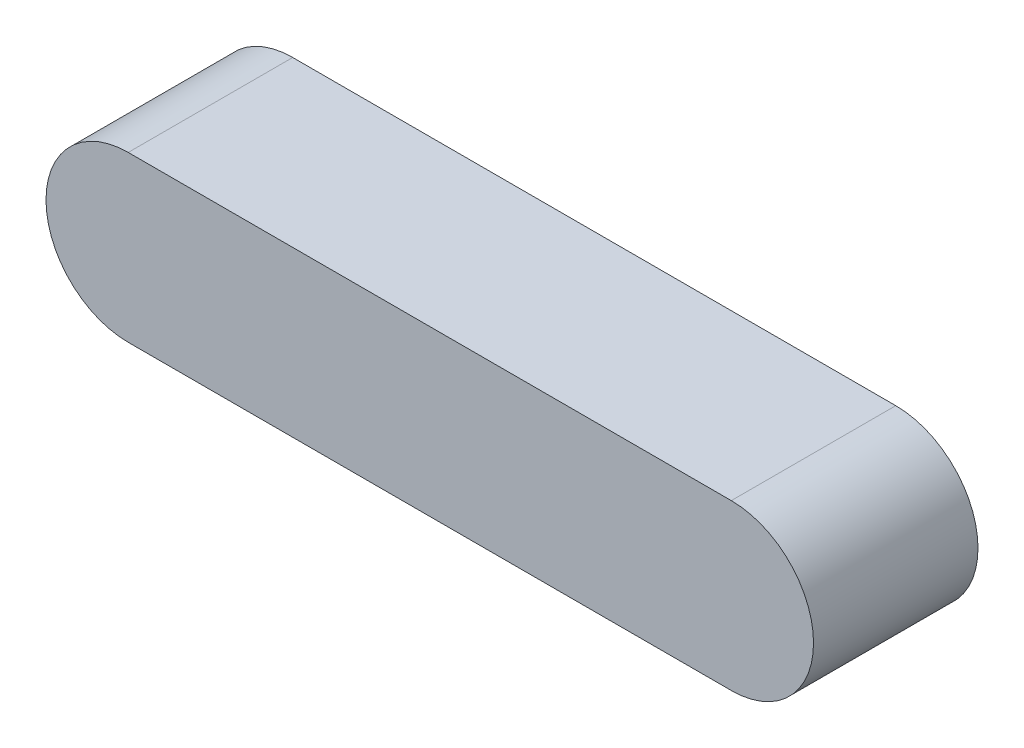
ISO-10303-21;
HEADER;
FILE_DESCRIPTION(('STEP AP214'),'2;1');
FILE_NAME('part.step','',(''),(''),'','','');
FILE_SCHEMA(('AUTOMOTIVE_DESIGN { 1 0 10303 214 1 1 1 1 }'));
ENDSEC;
DATA;
#1=APPLICATION_CONTEXT('core data for automotive mechanical design processes');
#2=APPLICATION_PROTOCOL_DEFINITION('international standard','automotive_design',2000,#1);
#3=PRODUCT_CONTEXT('',#1,'mechanical');
#4=PRODUCT('Part','Part','',(#3));
#5=PRODUCT_RELATED_PRODUCT_CATEGORY('part','',(#4));
#6=PRODUCT_DEFINITION_FORMATION('','',#4);
#7=PRODUCT_DEFINITION_CONTEXT('part definition',#1,'design');
#8=PRODUCT_DEFINITION('design','',#6,#7);
#9=PRODUCT_DEFINITION_SHAPE('','',#8);
#10=(LENGTH_UNIT() NAMED_UNIT(*) SI_UNIT(.MILLI.,.METRE.));
#11=(NAMED_UNIT(*) PLANE_ANGLE_UNIT() SI_UNIT($,.RADIAN.));
#12=(NAMED_UNIT(*) SI_UNIT($,.STERADIAN.) SOLID_ANGLE_UNIT());
#13=UNCERTAINTY_MEASURE_WITH_UNIT(LENGTH_MEASURE(1.E-05),#10,'distance_accuracy_value','');
#14=(GEOMETRIC_REPRESENTATION_CONTEXT(3) GLOBAL_UNCERTAINTY_ASSIGNED_CONTEXT((#13)) GLOBAL_UNIT_ASSIGNED_CONTEXT((#10,
#11,#12)) REPRESENTATION_CONTEXT('',''));
#15=CARTESIAN_POINT('',(0.,0.,0.));
#16=DIRECTION('',(0.,0.,1.));
#17=DIRECTION('',(1.,0.,0.));
#18=AXIS2_PLACEMENT_3D('',#15,#16,#17);
#19=CARTESIAN_POINT('',(-5.5,0.,3.));
#20=DIRECTION('',(0.,0.,-1.));
#21=DIRECTION('',(-1.,0.,0.));
#22=AXIS2_PLACEMENT_3D('',#19,#20,#21);
#23=CYLINDRICAL_SURFACE('',#22,1.5);
#24=CARTESIAN_POINT('',(-5.5,0.,0.));
#25=DIRECTION('',(0.,0.,1.));
#26=DIRECTION('',(1.,0.,0.));
#27=AXIS2_PLACEMENT_3D('',#24,#25,#26);
#28=CIRCLE('',#27,1.5);
#29=CARTESIAN_POINT('',(-5.5,1.5,0.));
#30=VERTEX_POINT('',#29);
#31=CARTESIAN_POINT('',(-5.5,-1.5,0.));
#32=VERTEX_POINT('',#31);
#33=EDGE_CURVE('E95',#30,#32,#28,.T.);
#34=ORIENTED_EDGE('',*,*,#33,.T.);
#35=DIRECTION('',(0.,0.,-1.));
#36=VECTOR('',#35,1.);
#37=CARTESIAN_POINT('',(-5.5,-1.5,3.));
#38=LINE('',#37,#36);
#39=CARTESIAN_POINT('',(-5.5,-1.5,3.));
#40=VERTEX_POINT('',#39);
#41=EDGE_CURVE('E11',#40,#32,#38,.T.);
#42=ORIENTED_EDGE('',*,*,#41,.F.);
#43=CARTESIAN_POINT('',(-5.5,0.,3.));
#44=DIRECTION('',(0.,0.,1.));
#45=DIRECTION('',(1.,0.,0.));
#46=AXIS2_PLACEMENT_3D('',#43,#44,#45);
#47=CIRCLE('',#46,1.5);
#48=CARTESIAN_POINT('',(-5.5,1.5,3.));
#49=VERTEX_POINT('',#48);
#50=EDGE_CURVE('E83',#49,#40,#47,.T.);
#51=ORIENTED_EDGE('',*,*,#50,.F.);
#52=DIRECTION('',(0.,0.,-1.));
#53=VECTOR('',#52,1.);
#54=CARTESIAN_POINT('',(-5.5,1.5,3.));
#55=LINE('',#54,#53);
#56=EDGE_CURVE('E91',#49,#30,#55,.T.);
#57=ORIENTED_EDGE('',*,*,#56,.T.);
#58=EDGE_LOOP('',(#34,#42,#51,#57));
#59=FACE_BOUND('',#58,.T.);
#60=ADVANCED_FACE('F32',(#59),#23,.T.);
#61=CARTESIAN_POINT('',(-5.5,-1.5,3.));
#62=DIRECTION('',(0.,1.,0.));
#63=DIRECTION('',(-1.,0.,0.));
#64=AXIS2_PLACEMENT_3D('',#61,#62,#63);
#65=PLANE('',#64);
#66=DIRECTION('',(1.,0.,0.));
#67=VECTOR('',#66,1.);
#68=CARTESIAN_POINT('',(-5.5,-1.5,0.));
#69=LINE('',#68,#67);
#70=CARTESIAN_POINT('',(5.5,-1.5,0.));
#71=VERTEX_POINT('',#70);
#72=EDGE_CURVE('E87',#32,#71,#69,.T.);
#73=ORIENTED_EDGE('',*,*,#72,.T.);
#74=DIRECTION('',(0.,0.,-1.));
#75=VECTOR('',#74,1.);
#76=CARTESIAN_POINT('',(5.5,-1.5,3.));
#77=LINE('',#76,#75);
#78=CARTESIAN_POINT('',(5.5,-1.5,3.));
#79=VERTEX_POINT('',#78);
#80=EDGE_CURVE('E40',#79,#71,#77,.T.);
#81=ORIENTED_EDGE('',*,*,#80,.F.);
#82=DIRECTION('',(1.,0.,0.));
#83=VECTOR('',#82,1.);
#84=CARTESIAN_POINT('',(-5.5,-1.5,3.));
#85=LINE('',#84,#83);
#86=EDGE_CURVE('E78',#40,#79,#85,.T.);
#87=ORIENTED_EDGE('',*,*,#86,.F.);
#88=ORIENTED_EDGE('',*,*,#41,.T.);
#89=EDGE_LOOP('',(#73,#81,#87,#88));
#90=FACE_BOUND('',#89,.T.);
#91=ADVANCED_FACE('F86',(#90),#65,.F.);
#92=CARTESIAN_POINT('',(5.5,0.,3.));
#93=DIRECTION('',(0.,0.,-1.));
#94=DIRECTION('',(-1.,0.,0.));
#95=AXIS2_PLACEMENT_3D('',#92,#93,#94);
#96=CYLINDRICAL_SURFACE('',#95,1.5);
#97=CARTESIAN_POINT('',(5.5,0.,0.));
#98=DIRECTION('',(0.,0.,1.));
#99=DIRECTION('',(1.,0.,0.));
#100=AXIS2_PLACEMENT_3D('',#97,#98,#99);
#101=CIRCLE('',#100,1.5);
#102=CARTESIAN_POINT('',(5.5,1.5,0.));
#103=VERTEX_POINT('',#102);
#104=EDGE_CURVE('E65',#71,#103,#101,.T.);
#105=ORIENTED_EDGE('',*,*,#104,.T.);
#106=DIRECTION('',(0.,0.,-1.));
#107=VECTOR('',#106,1.);
#108=CARTESIAN_POINT('',(5.5,1.5,3.));
#109=LINE('',#108,#107);
#110=CARTESIAN_POINT('',(5.5,1.5,3.));
#111=VERTEX_POINT('',#110);
#112=EDGE_CURVE('E88',#111,#103,#109,.T.);
#113=ORIENTED_EDGE('',*,*,#112,.F.);
#114=CARTESIAN_POINT('',(5.5,0.,3.));
#115=DIRECTION('',(0.,0.,1.));
#116=DIRECTION('',(1.,0.,0.));
#117=AXIS2_PLACEMENT_3D('',#114,#115,#116);
#118=CIRCLE('',#117,1.5);
#119=EDGE_CURVE('E81',#79,#111,#118,.T.);
#120=ORIENTED_EDGE('',*,*,#119,.F.);
#121=ORIENTED_EDGE('',*,*,#80,.T.);
#122=EDGE_LOOP('',(#105,#113,#120,#121));
#123=FACE_BOUND('',#122,.T.);
#124=ADVANCED_FACE('F89',(#123),#96,.T.);
#125=CARTESIAN_POINT('',(-5.5,1.5,3.));
#126=DIRECTION('',(0.,-1.,0.));
#127=DIRECTION('',(1.,0.,0.));
#128=AXIS2_PLACEMENT_3D('',#125,#126,#127);
#129=PLANE('',#128);
#130=DIRECTION('',(-1.,0.,0.));
#131=VECTOR('',#130,1.);
#132=CARTESIAN_POINT('',(-5.5,1.5,0.));
#133=LINE('',#132,#131);
#134=EDGE_CURVE('E71',#103,#30,#133,.T.);
#135=ORIENTED_EDGE('',*,*,#134,.T.);
#136=ORIENTED_EDGE('',*,*,#56,.F.);
#137=DIRECTION('',(-1.,0.,0.));
#138=VECTOR('',#137,1.);
#139=CARTESIAN_POINT('',(-5.5,1.5,3.));
#140=LINE('',#139,#138);
#141=EDGE_CURVE('E48',#111,#49,#140,.T.);
#142=ORIENTED_EDGE('',*,*,#141,.F.);
#143=ORIENTED_EDGE('',*,*,#112,.T.);
#144=EDGE_LOOP('',(#135,#136,#142,#143));
#145=FACE_BOUND('',#144,.T.);
#146=ADVANCED_FACE('F102',(#145),#129,.F.);
#147=CARTESIAN_POINT('',(-5.5,0.,3.));
#148=DIRECTION('',(0.,0.,1.));
#149=DIRECTION('',(1.,0.,0.));
#150=AXIS2_PLACEMENT_3D('',#147,#148,#149);
#151=PLANE('',#150);
#152=ORIENTED_EDGE('',*,*,#50,.T.);
#153=ORIENTED_EDGE('',*,*,#86,.T.);
#154=ORIENTED_EDGE('',*,*,#119,.T.);
#155=ORIENTED_EDGE('',*,*,#141,.T.);
#156=EDGE_LOOP('',(#152,#153,#154,#155));
#157=FACE_BOUND('',#156,.T.);
#158=ADVANCED_FACE('F79',(#157),#151,.T.);
#159=CARTESIAN_POINT('',(-5.5,0.,0.));
#160=DIRECTION('',(0.,0.,1.));
#161=DIRECTION('',(1.,0.,0.));
#162=AXIS2_PLACEMENT_3D('',#159,#160,#161);
#163=PLANE('',#162);
#164=ORIENTED_EDGE('',*,*,#33,.F.);
#165=ORIENTED_EDGE('',*,*,#134,.F.);
#166=ORIENTED_EDGE('',*,*,#104,.F.);
#167=ORIENTED_EDGE('',*,*,#72,.F.);
#168=EDGE_LOOP('',(#164,#165,#166,#167));
#169=FACE_BOUND('',#168,.T.);
#170=ADVANCED_FACE('F105',(#169),#163,.F.);
#171=CLOSED_SHELL('',(#60,#91,#124,#146,#158,#170));
#172=MANIFOLD_SOLID_BREP('B2',#171);
#173=ADVANCED_BREP_SHAPE_REPRESENTATION('',(#18,#172),#14);
#174=SHAPE_DEFINITION_REPRESENTATION(#9,#173);
ENDSEC;
END-ISO-10303-21;
